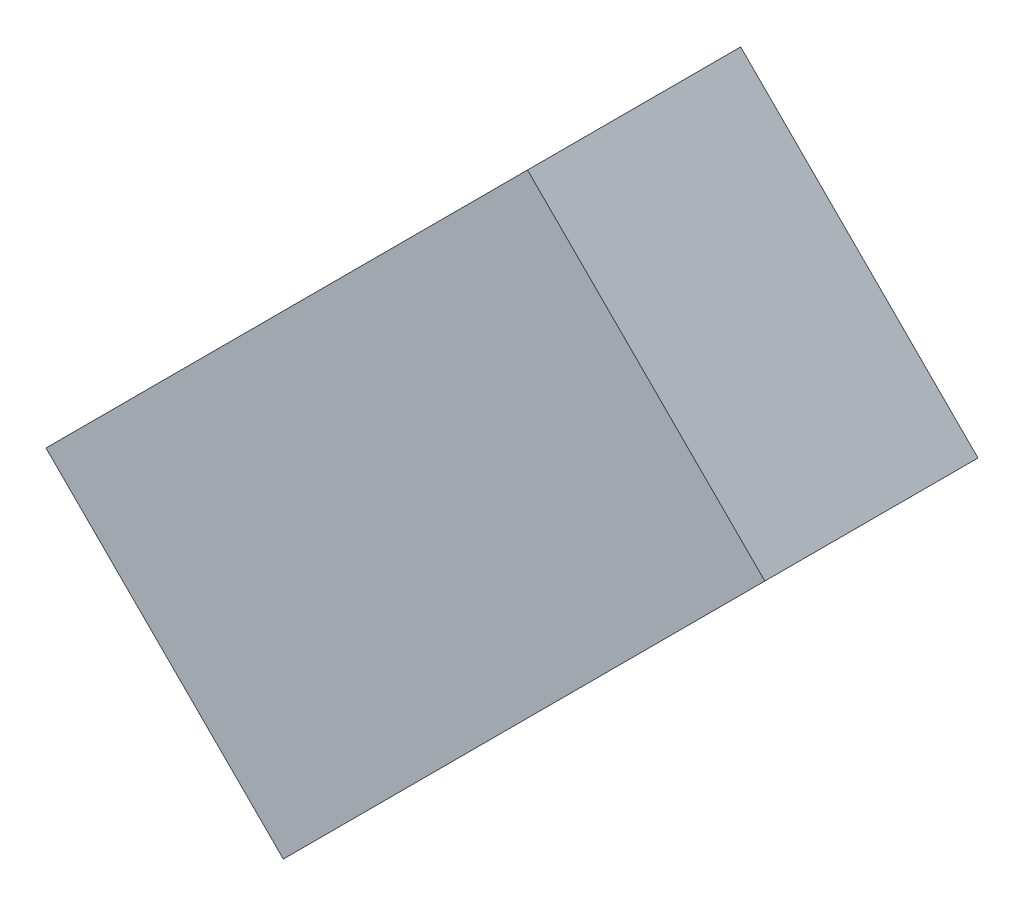
ISO-10303-21;
HEADER;
FILE_DESCRIPTION(('STEP AP214'),'2;1');
FILE_NAME('part.step','',(''),(''),'','','');
FILE_SCHEMA(('AUTOMOTIVE_DESIGN { 1 0 10303 214 1 1 1 1 }'));
ENDSEC;
DATA;
#1=APPLICATION_CONTEXT('core data for automotive mechanical design processes');
#2=APPLICATION_PROTOCOL_DEFINITION('international standard','automotive_design',2000,#1);
#3=PRODUCT_CONTEXT('',#1,'mechanical');
#4=PRODUCT('Part','Part','',(#3));
#5=PRODUCT_RELATED_PRODUCT_CATEGORY('part','',(#4));
#6=PRODUCT_DEFINITION_FORMATION('','',#4);
#7=PRODUCT_DEFINITION_CONTEXT('part definition',#1,'design');
#8=PRODUCT_DEFINITION('design','',#6,#7);
#9=PRODUCT_DEFINITION_SHAPE('','',#8);
#10=(LENGTH_UNIT() NAMED_UNIT(*) SI_UNIT(.MILLI.,.METRE.));
#11=(NAMED_UNIT(*) PLANE_ANGLE_UNIT() SI_UNIT($,.RADIAN.));
#12=(NAMED_UNIT(*) SI_UNIT($,.STERADIAN.) SOLID_ANGLE_UNIT());
#13=UNCERTAINTY_MEASURE_WITH_UNIT(LENGTH_MEASURE(1.E-05),#10,'distance_accuracy_value','');
#14=(GEOMETRIC_REPRESENTATION_CONTEXT(3) GLOBAL_UNCERTAINTY_ASSIGNED_CONTEXT((#13)) GLOBAL_UNIT_ASSIGNED_CONTEXT((#10,
#11,#12)) REPRESENTATION_CONTEXT('',''));
#15=CARTESIAN_POINT('',(0.,0.,0.));
#16=DIRECTION('',(0.,0.,1.));
#17=DIRECTION('',(1.,0.,0.));
#18=AXIS2_PLACEMENT_3D('',#15,#16,#17);
#19=CARTESIAN_POINT('',(19.1595886494445,-17.1102442985122,1.12000000000003));
#20=DIRECTION('',(0.,0.,-1.));
#21=DIRECTION('',(-1.,0.,0.));
#22=AXIS2_PLACEMENT_3D('',#19,#20,#21);
#23=PLANE('',#22);
#24=DIRECTION('',(-0.707106781186748,-0.707106781186347,0.));
#25=VECTOR('',#24,1.);
#26=CARTESIAN_POINT('',(-6.17319658950799,8.22254094045463,1.12000000000002));
#27=LINE('',#26,#25);
#28=CARTESIAN_POINT('',(-11.4347370216018,2.96100050836377,1.12000000000002));
#29=VERTEX_POINT('',#28);
#30=CARTESIAN_POINT('',(-9.17581999941379,5.21991753055053,1.12000000000002));
#31=VERTEX_POINT('',#30);
#32=EDGE_CURVE('E79',#29,#31,#27,.F.);
#33=ORIENTED_EDGE('',*,*,#32,.F.);
#34=DIRECTION('',(-0.707106781186348,0.707106781186747,0.));
#35=VECTOR('',#34,1.);
#36=CARTESIAN_POINT('',(13.8980482173507,-22.371784730603,1.12000000000002));
#37=LINE('',#36,#35);
#38=CARTESIAN_POINT('',(-10.3213140148906,1.84757750165191,1.12000000000002));
#39=VERTEX_POINT('',#38);
#40=EDGE_CURVE('E61',#29,#39,#37,.F.);
#41=ORIENTED_EDGE('',*,*,#40,.T.);
#42=DIRECTION('',(0.707106781186748,0.707106781186347,0.));
#43=VECTOR('',#42,1.);
#44=CARTESIAN_POINT('',(-5.05977358279676,7.10911793374277,1.12000000000002));
#45=LINE('',#44,#43);
#46=CARTESIAN_POINT('',(-8.06239699270256,4.10649452383867,1.12000000000002));
#47=VERTEX_POINT('',#46);
#48=EDGE_CURVE('E56',#47,#39,#45,.F.);
#49=ORIENTED_EDGE('',*,*,#48,.F.);
#50=DIRECTION('',(-0.707106781186348,0.707106781186747,0.));
#51=VECTOR('',#50,1.);
#52=CARTESIAN_POINT('',(16.1569652395387,-20.1128677084162,1.12000000000002));
#53=LINE('',#52,#51);
#54=EDGE_CURVE('E20',#31,#47,#53,.F.);
#55=ORIENTED_EDGE('',*,*,#54,.F.);
#56=EDGE_LOOP('',(#33,#41,#49,#55));
#57=FACE_BOUND('',#56,.T.);
#58=ADVANCED_FACE('F17',(#57),#23,.F.);
#59=CARTESIAN_POINT('',(16.1569652395387,-20.1128677084162,0.120000000000025));
#60=DIRECTION('',(0.707106781186747,0.707106781186348,0.));
#61=DIRECTION('',(-0.707106781186348,0.707106781186747,0.));
#62=AXIS2_PLACEMENT_3D('',#59,#60,#61);
#63=PLANE('',#62);
#64=DIRECTION('',(0.707106781186346,-0.707106781186749,0.));
#65=VECTOR('',#64,1.);
#66=CARTESIAN_POINT('',(-9.17581999941379,5.21991753055053,0.120000000000016));
#67=LINE('',#66,#65);
#68=CARTESIAN_POINT('',(-9.17581999941379,5.21991753055053,0.120000000000017));
#69=VERTEX_POINT('',#68);
#70=CARTESIAN_POINT('',(-8.06239699270256,4.10649452383867,0.120000000000016));
#71=VERTEX_POINT('',#70);
#72=EDGE_CURVE('E83',#69,#71,#67,.T.);
#73=ORIENTED_EDGE('',*,*,#72,.F.);
#74=DIRECTION('',(0.,0.,1.));
#75=VECTOR('',#74,1.);
#76=CARTESIAN_POINT('',(-9.17581999941379,5.21991753055053,0.120000000000018));
#77=LINE('',#76,#75);
#78=EDGE_CURVE('E68',#31,#69,#77,.F.);
#79=ORIENTED_EDGE('',*,*,#78,.F.);
#80=ORIENTED_EDGE('',*,*,#54,.T.);
#81=DIRECTION('',(0.,0.,1.));
#82=VECTOR('',#81,1.);
#83=CARTESIAN_POINT('',(-8.06239699270257,4.10649452383867,0.120000000000019));
#84=LINE('',#83,#82);
#85=EDGE_CURVE('E63',#71,#47,#84,.T.);
#86=ORIENTED_EDGE('',*,*,#85,.F.);
#87=EDGE_LOOP('',(#73,#79,#80,#86));
#88=FACE_BOUND('',#87,.T.);
#89=ADVANCED_FACE('F65',(#88),#63,.T.);
#90=CARTESIAN_POINT('',(-5.05977358279676,7.10911793374277,0.120000000000019));
#91=DIRECTION('',(0.707106781186347,-0.707106781186748,0.));
#92=DIRECTION('',(0.707106781186748,0.707106781186347,0.));
#93=AXIS2_PLACEMENT_3D('',#90,#91,#92);
#94=PLANE('',#93);
#95=DIRECTION('',(-0.707106781186747,-0.707106781186348,0.));
#96=VECTOR('',#95,1.);
#97=CARTESIAN_POINT('',(-8.06239699270256,4.10649452383867,0.120000000000017));
#98=LINE('',#97,#96);
#99=CARTESIAN_POINT('',(-10.3213140148906,1.84757750165191,0.120000000000015));
#100=VERTEX_POINT('',#99);
#101=EDGE_CURVE('E72',#71,#100,#98,.T.);
#102=ORIENTED_EDGE('',*,*,#101,.F.);
#103=ORIENTED_EDGE('',*,*,#85,.T.);
#104=ORIENTED_EDGE('',*,*,#48,.T.);
#105=DIRECTION('',(0.,0.,1.));
#106=VECTOR('',#105,1.);
#107=CARTESIAN_POINT('',(-10.3213140148906,1.84757750165191,0.120000000000023));
#108=LINE('',#107,#106);
#109=EDGE_CURVE('E74',#39,#100,#108,.F.);
#110=ORIENTED_EDGE('',*,*,#109,.T.);
#111=EDGE_LOOP('',(#102,#103,#104,#110));
#112=FACE_BOUND('',#111,.T.);
#113=ADVANCED_FACE('F70',(#112),#94,.T.);
#114=CARTESIAN_POINT('',(13.8980482173507,-22.371784730603,0.120000000000023));
#115=DIRECTION('',(0.707106781186747,0.707106781186348,0.));
#116=DIRECTION('',(-0.707106781186348,0.707106781186747,0.));
#117=AXIS2_PLACEMENT_3D('',#114,#115,#116);
#118=PLANE('',#117);
#119=DIRECTION('',(0.,0.,1.));
#120=VECTOR('',#119,1.);
#121=CARTESIAN_POINT('',(-11.4347370216018,2.96100050836377,0.120000000000018));
#122=LINE('',#121,#120);
#123=CARTESIAN_POINT('',(-11.4347370216018,2.96100050836377,0.120000000000016));
#124=VERTEX_POINT('',#123);
#125=EDGE_CURVE('E35',#124,#29,#122,.T.);
#126=ORIENTED_EDGE('',*,*,#125,.F.);
#127=DIRECTION('',(-0.707106781186349,0.707106781186746,0.));
#128=VECTOR('',#127,1.);
#129=CARTESIAN_POINT('',(-10.3213140148906,1.84757750165191,0.120000000000015));
#130=LINE('',#129,#128);
#131=EDGE_CURVE('E26',#100,#124,#130,.T.);
#132=ORIENTED_EDGE('',*,*,#131,.F.);
#133=ORIENTED_EDGE('',*,*,#109,.F.);
#134=ORIENTED_EDGE('',*,*,#40,.F.);
#135=EDGE_LOOP('',(#126,#132,#133,#134));
#136=FACE_BOUND('',#135,.T.);
#137=ADVANCED_FACE('F89',(#136),#118,.F.);
#138=CARTESIAN_POINT('',(-6.17319658950799,8.22254094045463,0.120000000000018));
#139=DIRECTION('',(-0.707106781186347,0.707106781186748,0.));
#140=DIRECTION('',(-0.707106781186748,-0.707106781186347,0.));
#141=AXIS2_PLACEMENT_3D('',#138,#139,#140);
#142=PLANE('',#141);
#143=DIRECTION('',(0.707106781186748,0.707106781186347,0.));
#144=VECTOR('',#143,1.);
#145=CARTESIAN_POINT('',(-11.4347370216018,2.96100050836377,0.120000000000015));
#146=LINE('',#145,#144);
#147=EDGE_CURVE('E11',#124,#69,#146,.T.);
#148=ORIENTED_EDGE('',*,*,#147,.F.);
#149=ORIENTED_EDGE('',*,*,#125,.T.);
#150=ORIENTED_EDGE('',*,*,#32,.T.);
#151=ORIENTED_EDGE('',*,*,#78,.T.);
#152=EDGE_LOOP('',(#148,#149,#150,#151));
#153=FACE_BOUND('',#152,.T.);
#154=ADVANCED_FACE('F91',(#153),#142,.T.);
#155=CARTESIAN_POINT('',(19.1595886494445,-17.1102442985122,0.120000000000027));
#156=DIRECTION('',(0.,0.,-1.));
#157=DIRECTION('',(-1.,0.,0.));
#158=AXIS2_PLACEMENT_3D('',#155,#156,#157);
#159=PLANE('',#158);
#160=ORIENTED_EDGE('',*,*,#131,.T.);
#161=ORIENTED_EDGE('',*,*,#147,.T.);
#162=ORIENTED_EDGE('',*,*,#72,.T.);
#163=ORIENTED_EDGE('',*,*,#101,.T.);
#164=EDGE_LOOP('',(#160,#161,#162,#163));
#165=FACE_BOUND('',#164,.T.);
#166=ADVANCED_FACE('F88',(#165),#159,.T.);
#167=CLOSED_SHELL('',(#58,#89,#113,#137,#154,#166));
#168=MANIFOLD_SOLID_BREP('B1',#167);
#169=ADVANCED_BREP_SHAPE_REPRESENTATION('',(#18,#168),#14);
#170=SHAPE_DEFINITION_REPRESENTATION(#9,#169);
ENDSEC;
END-ISO-10303-21;
